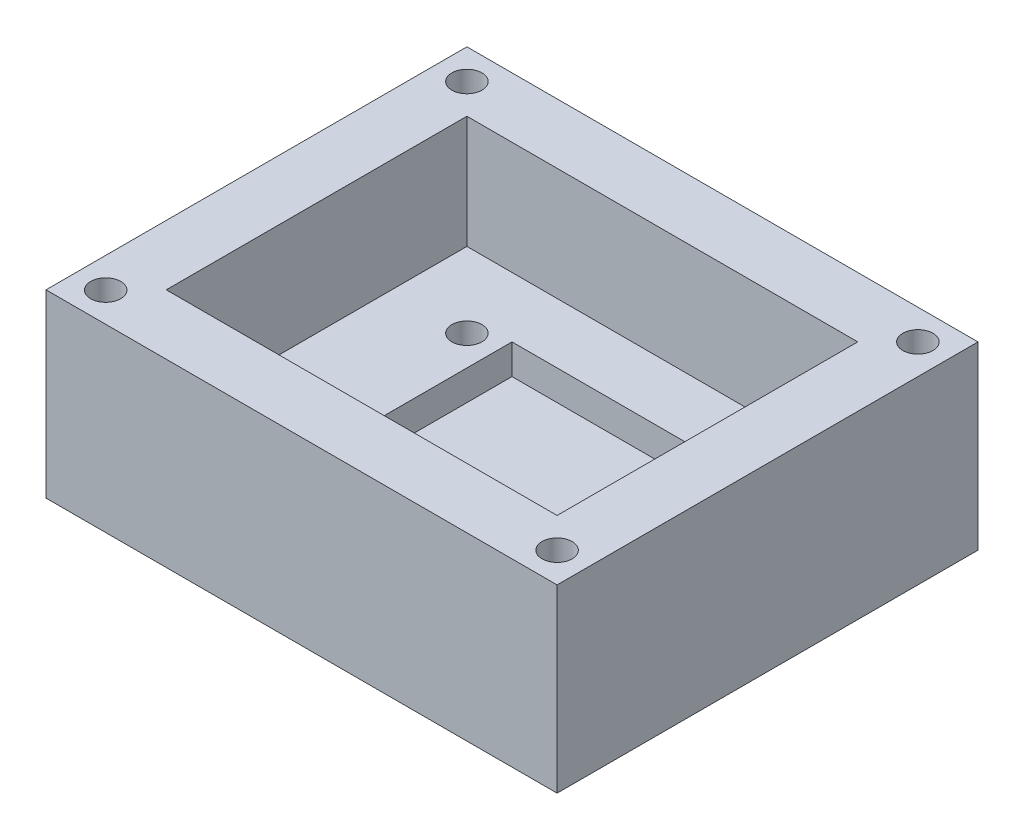
ISO-10303-21;
HEADER;
FILE_DESCRIPTION(('STEP AP214'),'2;1');
FILE_NAME('part.step','',(''),(''),'','','');
FILE_SCHEMA(('AUTOMOTIVE_DESIGN { 1 0 10303 214 1 1 1 1 }'));
ENDSEC;
DATA;
#1=APPLICATION_CONTEXT('core data for automotive mechanical design processes');
#2=APPLICATION_PROTOCOL_DEFINITION('international standard','automotive_design',2000,#1);
#3=PRODUCT_CONTEXT('',#1,'mechanical');
#4=PRODUCT('Part','Part','',(#3));
#5=PRODUCT_RELATED_PRODUCT_CATEGORY('part','',(#4));
#6=PRODUCT_DEFINITION_FORMATION('','',#4);
#7=PRODUCT_DEFINITION_CONTEXT('part definition',#1,'design');
#8=PRODUCT_DEFINITION('design','',#6,#7);
#9=PRODUCT_DEFINITION_SHAPE('','',#8);
#10=(LENGTH_UNIT() NAMED_UNIT(*) SI_UNIT(.MILLI.,.METRE.));
#11=(NAMED_UNIT(*) PLANE_ANGLE_UNIT() SI_UNIT($,.RADIAN.));
#12=(NAMED_UNIT(*) SI_UNIT($,.STERADIAN.) SOLID_ANGLE_UNIT());
#13=UNCERTAINTY_MEASURE_WITH_UNIT(LENGTH_MEASURE(1.E-05),#10,'distance_accuracy_value','');
#14=(GEOMETRIC_REPRESENTATION_CONTEXT(3) GLOBAL_UNCERTAINTY_ASSIGNED_CONTEXT((#13)) GLOBAL_UNIT_ASSIGNED_CONTEXT((#10,
#11,#12)) REPRESENTATION_CONTEXT('',''));
#15=CARTESIAN_POINT('',(0.,0.,0.));
#16=DIRECTION('',(0.,0.,1.));
#17=DIRECTION('',(1.,0.,0.));
#18=AXIS2_PLACEMENT_3D('',#15,#16,#17);
#19=CARTESIAN_POINT('',(-16.6948356807512,15.24,-8.70516431924882));
#20=DIRECTION('',(1.,0.,0.));
#21=DIRECTION('',(0.,0.,-1.));
#22=AXIS2_PLACEMENT_3D('',#19,#20,#21);
#23=PLANE('',#22);
#24=DIRECTION('',(0.,0.,1.));
#25=VECTOR('',#24,1.);
#26=CARTESIAN_POINT('',(-16.6948356807512,0.,-8.70516431924882));
#27=LINE('',#26,#25);
#28=CARTESIAN_POINT('',(-16.6948356807512,0.,-8.70516431924882));
#29=VERTEX_POINT('',#28);
#30=CARTESIAN_POINT('',(-16.6948356807512,0.,26.8548356807512));
#31=VERTEX_POINT('',#30);
#32=EDGE_CURVE('E189',#29,#31,#27,.T.);
#33=ORIENTED_EDGE('',*,*,#32,.T.);
#34=DIRECTION('',(0.,-1.,0.));
#35=VECTOR('',#34,1.);
#36=CARTESIAN_POINT('',(-16.6948356807512,15.24,26.8548356807512));
#37=LINE('',#36,#35);
#38=CARTESIAN_POINT('',(-16.6948356807512,15.24,26.8548356807512));
#39=VERTEX_POINT('',#38);
#40=EDGE_CURVE('E11',#39,#31,#37,.T.);
#41=ORIENTED_EDGE('',*,*,#40,.F.);
#42=DIRECTION('',(0.,0.,1.));
#43=VECTOR('',#42,1.);
#44=CARTESIAN_POINT('',(-16.6948356807512,15.24,-8.70516431924882));
#45=LINE('',#44,#43);
#46=CARTESIAN_POINT('',(-16.6948356807512,15.24,-8.70516431924882));
#47=VERTEX_POINT('',#46);
#48=EDGE_CURVE('E195',#47,#39,#45,.T.);
#49=ORIENTED_EDGE('',*,*,#48,.F.);
#50=DIRECTION('',(0.,-1.,0.));
#51=VECTOR('',#50,1.);
#52=CARTESIAN_POINT('',(-16.6948356807512,15.24,-8.70516431924882));
#53=LINE('',#52,#51);
#54=EDGE_CURVE('E205',#47,#29,#53,.T.);
#55=ORIENTED_EDGE('',*,*,#54,.T.);
#56=EDGE_LOOP('',(#33,#41,#49,#55));
#57=FACE_BOUND('',#56,.T.);
#58=ADVANCED_FACE('F32',(#57),#23,.F.);
#59=CARTESIAN_POINT('',(-16.6948356807512,15.24,26.8548356807512));
#60=DIRECTION('',(0.,0.,-1.));
#61=DIRECTION('',(-1.,0.,0.));
#62=AXIS2_PLACEMENT_3D('',#59,#60,#61);
#63=PLANE('',#62);
#64=DIRECTION('',(1.,0.,0.));
#65=VECTOR('',#64,1.);
#66=CARTESIAN_POINT('',(-16.6948356807512,0.,26.8548356807512));
#67=LINE('',#66,#65);
#68=CARTESIAN_POINT('',(26.4851643192488,0.,26.8548356807512));
#69=VERTEX_POINT('',#68);
#70=EDGE_CURVE('E208',#31,#69,#67,.T.);
#71=ORIENTED_EDGE('',*,*,#70,.T.);
#72=DIRECTION('',(0.,-1.,0.));
#73=VECTOR('',#72,1.);
#74=CARTESIAN_POINT('',(26.4851643192488,15.24,26.8548356807512));
#75=LINE('',#74,#73);
#76=CARTESIAN_POINT('',(26.4851643192488,15.24,26.8548356807512));
#77=VERTEX_POINT('',#76);
#78=EDGE_CURVE('E39',#77,#69,#75,.T.);
#79=ORIENTED_EDGE('',*,*,#78,.F.);
#80=DIRECTION('',(1.,0.,0.));
#81=VECTOR('',#80,1.);
#82=CARTESIAN_POINT('',(-16.6948356807512,15.24,26.8548356807512));
#83=LINE('',#82,#81);
#84=EDGE_CURVE('E198',#39,#77,#83,.T.);
#85=ORIENTED_EDGE('',*,*,#84,.F.);
#86=ORIENTED_EDGE('',*,*,#40,.T.);
#87=EDGE_LOOP('',(#71,#79,#85,#86));
#88=FACE_BOUND('',#87,.T.);
#89=ADVANCED_FACE('F238',(#88),#63,.F.);
#90=CARTESIAN_POINT('',(26.4851643192488,15.24,-8.70516431924882));
#91=DIRECTION('',(-1.,0.,0.));
#92=DIRECTION('',(0.,0.,1.));
#93=AXIS2_PLACEMENT_3D('',#90,#91,#92);
#94=PLANE('',#93);
#95=DIRECTION('',(0.,0.,-1.));
#96=VECTOR('',#95,1.);
#97=CARTESIAN_POINT('',(26.4851643192488,0.,-8.70516431924882));
#98=LINE('',#97,#96);
#99=CARTESIAN_POINT('',(26.4851643192488,0.,-8.70516431924882));
#100=VERTEX_POINT('',#99);
#101=EDGE_CURVE('E210',#69,#100,#98,.T.);
#102=ORIENTED_EDGE('',*,*,#101,.T.);
#103=DIRECTION('',(0.,-1.,0.));
#104=VECTOR('',#103,1.);
#105=CARTESIAN_POINT('',(26.4851643192488,15.24,-8.70516431924882));
#106=LINE('',#105,#104);
#107=CARTESIAN_POINT('',(26.4851643192488,15.24,-8.70516431924882));
#108=VERTEX_POINT('',#107);
#109=EDGE_CURVE('E215',#108,#100,#106,.T.);
#110=ORIENTED_EDGE('',*,*,#109,.F.);
#111=DIRECTION('',(0.,0.,-1.));
#112=VECTOR('',#111,1.);
#113=CARTESIAN_POINT('',(26.4851643192488,15.24,-8.70516431924882));
#114=LINE('',#113,#112);
#115=EDGE_CURVE('E201',#77,#108,#114,.T.);
#116=ORIENTED_EDGE('',*,*,#115,.F.);
#117=ORIENTED_EDGE('',*,*,#78,.T.);
#118=EDGE_LOOP('',(#102,#110,#116,#117));
#119=FACE_BOUND('',#118,.T.);
#120=ADVANCED_FACE('F222',(#119),#94,.F.);
#121=CARTESIAN_POINT('',(-16.6948356807512,15.24,-8.70516431924882));
#122=DIRECTION('',(0.,0.,1.));
#123=DIRECTION('',(1.,0.,0.));
#124=AXIS2_PLACEMENT_3D('',#121,#122,#123);
#125=PLANE('',#124);
#126=DIRECTION('',(-1.,0.,0.));
#127=VECTOR('',#126,1.);
#128=CARTESIAN_POINT('',(-16.6948356807512,0.,-8.70516431924882));
#129=LINE('',#128,#127);
#130=EDGE_CURVE('E199',#100,#29,#129,.T.);
#131=ORIENTED_EDGE('',*,*,#130,.T.);
#132=ORIENTED_EDGE('',*,*,#54,.F.);
#133=DIRECTION('',(-1.,0.,0.));
#134=VECTOR('',#133,1.);
#135=CARTESIAN_POINT('',(-16.6948356807512,15.24,-8.70516431924882));
#136=LINE('',#135,#134);
#137=EDGE_CURVE('E203',#108,#47,#136,.T.);
#138=ORIENTED_EDGE('',*,*,#137,.F.);
#139=ORIENTED_EDGE('',*,*,#109,.T.);
#140=EDGE_LOOP('',(#131,#132,#138,#139));
#141=FACE_BOUND('',#140,.T.);
#142=ADVANCED_FACE('F231',(#141),#125,.F.);
#143=CARTESIAN_POINT('',(0.,15.24,0.));
#144=DIRECTION('',(0.,1.,0.));
#145=DIRECTION('',(0.,0.,1.));
#146=AXIS2_PLACEMENT_3D('',#143,#144,#145);
#147=PLANE('',#146);
#148=CARTESIAN_POINT('',(-14.1548356807512,15.24,24.3531912337531));
#149=DIRECTION('',(0.,1.,0.));
#150=DIRECTION('',(0.,0.,1.));
#151=AXIS2_PLACEMENT_3D('',#148,#149,#150);
#152=CIRCLE('',#151,1.27);
#153=CARTESIAN_POINT('',(-14.1548356807512,15.24,25.6231912337531));
#154=VERTEX_POINT('',#153);
#155=EDGE_CURVE('E335',#154,#154,#152,.T.);
#156=ORIENTED_EDGE('',*,*,#155,.F.);
#157=EDGE_LOOP('',(#156));
#158=FACE_BOUND('',#157,.T.);
#159=CARTESIAN_POINT('',(23.9451643192488,15.24,-6.16516431924882));
#160=DIRECTION('',(0.,1.,0.));
#161=DIRECTION('',(0.,0.,1.));
#162=AXIS2_PLACEMENT_3D('',#159,#160,#161);
#163=CIRCLE('',#162,1.27);
#164=CARTESIAN_POINT('',(23.9451643192488,15.24,-4.89516431924882));
#165=VERTEX_POINT('',#164);
#166=EDGE_CURVE('E328',#165,#165,#163,.T.);
#167=ORIENTED_EDGE('',*,*,#166,.F.);
#168=EDGE_LOOP('',(#167));
#169=FACE_BOUND('',#168,.T.);
#170=CARTESIAN_POINT('',(23.9451643192488,15.24,24.3148356807512));
#171=DIRECTION('',(0.,1.,0.));
#172=DIRECTION('',(0.,0.,1.));
#173=AXIS2_PLACEMENT_3D('',#170,#171,#172);
#174=CIRCLE('',#173,1.27);
#175=CARTESIAN_POINT('',(23.9451643192488,15.24,25.5848356807512));
#176=VERTEX_POINT('',#175);
#177=EDGE_CURVE('E325',#176,#176,#174,.T.);
#178=ORIENTED_EDGE('',*,*,#177,.F.);
#179=EDGE_LOOP('',(#178));
#180=FACE_BOUND('',#179,.T.);
#181=CARTESIAN_POINT('',(-14.1548356807512,15.24,-6.16516431924882));
#182=DIRECTION('',(0.,1.,0.));
#183=DIRECTION('',(0.,0.,1.));
#184=AXIS2_PLACEMENT_3D('',#181,#182,#183);
#185=CIRCLE('',#184,1.27);
#186=CARTESIAN_POINT('',(-14.1548356807512,15.24,-4.89516431924882));
#187=VERTEX_POINT('',#186);
#188=EDGE_CURVE('E334',#187,#187,#185,.T.);
#189=ORIENTED_EDGE('',*,*,#188,.F.);
#190=EDGE_LOOP('',(#189));
#191=FACE_BOUND('',#190,.T.);
#192=DIRECTION('',(0.,0.,1.));
#193=VECTOR('',#192,1.);
#194=CARTESIAN_POINT('',(-11.6148356807512,15.24,-3.62516431924883));
#195=LINE('',#194,#193);
#196=CARTESIAN_POINT('',(-11.6148356807512,15.24,-3.62516431924883));
#197=VERTEX_POINT('',#196);
#198=CARTESIAN_POINT('',(-11.6148356807512,15.24,21.7748356807512));
#199=VERTEX_POINT('',#198);
#200=EDGE_CURVE('E54',#197,#199,#195,.T.);
#201=ORIENTED_EDGE('',*,*,#200,.F.);
#202=DIRECTION('',(-1.,0.,0.));
#203=VECTOR('',#202,1.);
#204=CARTESIAN_POINT('',(-11.6148356807512,15.24,-3.62516431924883));
#205=LINE('',#204,#203);
#206=CARTESIAN_POINT('',(21.4051643192488,15.24,-3.62516431924883));
#207=VERTEX_POINT('',#206);
#208=EDGE_CURVE('E168',#207,#197,#205,.T.);
#209=ORIENTED_EDGE('',*,*,#208,.F.);
#210=DIRECTION('',(0.,0.,-1.));
#211=VECTOR('',#210,1.);
#212=CARTESIAN_POINT('',(21.4051643192488,15.24,-3.62516431924883));
#213=LINE('',#212,#211);
#214=CARTESIAN_POINT('',(21.4051643192488,15.24,21.7748356807512));
#215=VERTEX_POINT('',#214);
#216=EDGE_CURVE('E182',#215,#207,#213,.T.);
#217=ORIENTED_EDGE('',*,*,#216,.F.);
#218=DIRECTION('',(1.,0.,0.));
#219=VECTOR('',#218,1.);
#220=CARTESIAN_POINT('',(-11.6148356807512,15.24,21.7748356807512));
#221=LINE('',#220,#219);
#222=EDGE_CURVE('E179',#199,#215,#221,.T.);
#223=ORIENTED_EDGE('',*,*,#222,.F.);
#224=EDGE_LOOP('',(#201,#209,#217,#223));
#225=FACE_BOUND('',#224,.T.);
#226=ORIENTED_EDGE('',*,*,#48,.T.);
#227=ORIENTED_EDGE('',*,*,#84,.T.);
#228=ORIENTED_EDGE('',*,*,#115,.T.);
#229=ORIENTED_EDGE('',*,*,#137,.T.);
#230=EDGE_LOOP('',(#226,#227,#228,#229));
#231=FACE_BOUND('',#230,.T.);
#232=ADVANCED_FACE('F237',(#158,#169,#180,#191,#225,#231),#147,.T.);
#233=CARTESIAN_POINT('',(0.,0.,0.));
#234=DIRECTION('',(0.,1.,0.));
#235=DIRECTION('',(0.,0.,1.));
#236=AXIS2_PLACEMENT_3D('',#233,#234,#235);
#237=PLANE('',#236);
#238=CARTESIAN_POINT('',(-14.1548356807512,0.,24.3531912337531));
#239=DIRECTION('',(0.,1.,0.));
#240=DIRECTION('',(0.,0.,1.));
#241=AXIS2_PLACEMENT_3D('',#238,#239,#240);
#242=CIRCLE('',#241,1.27);
#243=CARTESIAN_POINT('',(-14.1548356807512,0.,25.6231912337531));
#244=VERTEX_POINT('',#243);
#245=EDGE_CURVE('E331',#244,#244,#242,.T.);
#246=ORIENTED_EDGE('',*,*,#245,.T.);
#247=EDGE_LOOP('',(#246));
#248=FACE_BOUND('',#247,.T.);
#249=CARTESIAN_POINT('',(23.9451643192488,0.,-6.16516431924882));
#250=DIRECTION('',(0.,1.,0.));
#251=DIRECTION('',(0.,0.,1.));
#252=AXIS2_PLACEMENT_3D('',#249,#250,#251);
#253=CIRCLE('',#252,1.27);
#254=CARTESIAN_POINT('',(23.9451643192488,0.,-4.89516431924882));
#255=VERTEX_POINT('',#254);
#256=EDGE_CURVE('E338',#255,#255,#253,.T.);
#257=ORIENTED_EDGE('',*,*,#256,.T.);
#258=EDGE_LOOP('',(#257));
#259=FACE_BOUND('',#258,.T.);
#260=CARTESIAN_POINT('',(23.9451643192488,0.,24.3148356807512));
#261=DIRECTION('',(0.,1.,0.));
#262=DIRECTION('',(0.,0.,1.));
#263=AXIS2_PLACEMENT_3D('',#260,#261,#262);
#264=CIRCLE('',#263,1.27);
#265=CARTESIAN_POINT('',(23.9451643192488,0.,25.5848356807512));
#266=VERTEX_POINT('',#265);
#267=EDGE_CURVE('E322',#266,#266,#264,.T.);
#268=ORIENTED_EDGE('',*,*,#267,.T.);
#269=EDGE_LOOP('',(#268));
#270=FACE_BOUND('',#269,.T.);
#271=CARTESIAN_POINT('',(-14.1548356807512,0.,-6.16516431924882));
#272=DIRECTION('',(0.,1.,0.));
#273=DIRECTION('',(0.,0.,1.));
#274=AXIS2_PLACEMENT_3D('',#271,#272,#273);
#275=CIRCLE('',#274,1.27);
#276=CARTESIAN_POINT('',(-14.1548356807512,0.,-4.89516431924882));
#277=VERTEX_POINT('',#276);
#278=EDGE_CURVE('E343',#277,#277,#275,.T.);
#279=ORIENTED_EDGE('',*,*,#278,.T.);
#280=EDGE_LOOP('',(#279));
#281=FACE_BOUND('',#280,.T.);
#282=CARTESIAN_POINT('',(-5.26483568075119,0.,15.4248356807512));
#283=DIRECTION('',(0.,1.,0.));
#284=DIRECTION('',(0.,0.,1.));
#285=AXIS2_PLACEMENT_3D('',#282,#283,#284);
#286=CIRCLE('',#285,1.27);
#287=CARTESIAN_POINT('',(-5.26483568075119,0.,16.6948356807512));
#288=VERTEX_POINT('',#287);
#289=EDGE_CURVE('E355',#288,#288,#286,.T.);
#290=ORIENTED_EDGE('',*,*,#289,.T.);
#291=EDGE_LOOP('',(#290));
#292=FACE_BOUND('',#291,.T.);
#293=CARTESIAN_POINT('',(15.0551643192488,0.,2.72483568075117));
#294=DIRECTION('',(0.,1.,0.));
#295=DIRECTION('',(0.,0.,1.));
#296=AXIS2_PLACEMENT_3D('',#293,#294,#295);
#297=CIRCLE('',#296,1.27);
#298=CARTESIAN_POINT('',(15.0551643192488,0.,3.99483568075117));
#299=VERTEX_POINT('',#298);
#300=EDGE_CURVE('E361',#299,#299,#297,.T.);
#301=ORIENTED_EDGE('',*,*,#300,.T.);
#302=EDGE_LOOP('',(#301));
#303=FACE_BOUND('',#302,.T.);
#304=CARTESIAN_POINT('',(15.0551643192488,0.,15.4248356807512));
#305=DIRECTION('',(0.,1.,0.));
#306=DIRECTION('',(0.,0.,1.));
#307=AXIS2_PLACEMENT_3D('',#304,#305,#306);
#308=CIRCLE('',#307,1.27);
#309=CARTESIAN_POINT('',(15.0551643192488,0.,16.6948356807512));
#310=VERTEX_POINT('',#309);
#311=EDGE_CURVE('E349',#310,#310,#308,.T.);
#312=ORIENTED_EDGE('',*,*,#311,.T.);
#313=EDGE_LOOP('',(#312));
#314=FACE_BOUND('',#313,.T.);
#315=CARTESIAN_POINT('',(-5.26483568075119,0.,2.72483568075117));
#316=DIRECTION('',(0.,1.,0.));
#317=DIRECTION('',(0.,0.,1.));
#318=AXIS2_PLACEMENT_3D('',#315,#316,#317);
#319=CIRCLE('',#318,1.27);
#320=CARTESIAN_POINT('',(-5.26483568075119,0.,3.99483568075117));
#321=VERTEX_POINT('',#320);
#322=EDGE_CURVE('E156',#321,#321,#319,.T.);
#323=ORIENTED_EDGE('',*,*,#322,.T.);
#324=EDGE_LOOP('',(#323));
#325=FACE_BOUND('',#324,.T.);
#326=ORIENTED_EDGE('',*,*,#32,.F.);
#327=ORIENTED_EDGE('',*,*,#130,.F.);
#328=ORIENTED_EDGE('',*,*,#101,.F.);
#329=ORIENTED_EDGE('',*,*,#70,.F.);
#330=EDGE_LOOP('',(#326,#327,#328,#329));
#331=FACE_BOUND('',#330,.T.);
#332=ADVANCED_FACE('F228',(#248,#259,#270,#281,#292,#303,#314,#325,#331),#237,.F.);
#333=CARTESIAN_POINT('',(-11.6148356807512,5.715,-3.62516431924883));
#334=DIRECTION('',(-1.,0.,0.));
#335=DIRECTION('',(0.,0.,1.));
#336=AXIS2_PLACEMENT_3D('',#333,#334,#335);
#337=PLANE('',#336);
#338=ORIENTED_EDGE('',*,*,#200,.T.);
#339=DIRECTION('',(0.,1.,0.));
#340=VECTOR('',#339,1.);
#341=CARTESIAN_POINT('',(-11.6148356807512,5.715,21.7748356807512));
#342=LINE('',#341,#340);
#343=CARTESIAN_POINT('',(-11.6148356807512,5.715,21.7748356807512));
#344=VERTEX_POINT('',#343);
#345=EDGE_CURVE('E177',#344,#199,#342,.T.);
#346=ORIENTED_EDGE('',*,*,#345,.F.);
#347=DIRECTION('',(0.,0.,1.));
#348=VECTOR('',#347,1.);
#349=CARTESIAN_POINT('',(-11.6148356807512,5.715,-3.62516431924883));
#350=LINE('',#349,#348);
#351=CARTESIAN_POINT('',(-11.6148356807512,5.715,-3.62516431924883));
#352=VERTEX_POINT('',#351);
#353=EDGE_CURVE('E164',#352,#344,#350,.T.);
#354=ORIENTED_EDGE('',*,*,#353,.F.);
#355=DIRECTION('',(0.,1.,0.));
#356=VECTOR('',#355,1.);
#357=CARTESIAN_POINT('',(-11.6148356807512,5.715,-3.62516431924883));
#358=LINE('',#357,#356);
#359=EDGE_CURVE('E187',#352,#197,#358,.T.);
#360=ORIENTED_EDGE('',*,*,#359,.T.);
#361=EDGE_LOOP('',(#338,#346,#354,#360));
#362=FACE_BOUND('',#361,.T.);
#363=ADVANCED_FACE('F250',(#362),#337,.F.);
#364=CARTESIAN_POINT('',(-11.6148356807512,5.715,-3.62516431924883));
#365=DIRECTION('',(0.,0.,-1.));
#366=DIRECTION('',(-1.,0.,0.));
#367=AXIS2_PLACEMENT_3D('',#364,#365,#366);
#368=PLANE('',#367);
#369=ORIENTED_EDGE('',*,*,#208,.T.);
#370=ORIENTED_EDGE('',*,*,#359,.F.);
#371=DIRECTION('',(-1.,0.,0.));
#372=VECTOR('',#371,1.);
#373=CARTESIAN_POINT('',(-11.6148356807512,5.715,-3.62516431924883));
#374=LINE('',#373,#372);
#375=CARTESIAN_POINT('',(21.4051643192488,5.715,-3.62516431924883));
#376=VERTEX_POINT('',#375);
#377=EDGE_CURVE('E174',#376,#352,#374,.T.);
#378=ORIENTED_EDGE('',*,*,#377,.F.);
#379=DIRECTION('',(0.,1.,0.));
#380=VECTOR('',#379,1.);
#381=CARTESIAN_POINT('',(21.4051643192488,5.715,-3.62516431924883));
#382=LINE('',#381,#380);
#383=EDGE_CURVE('E190',#376,#207,#382,.T.);
#384=ORIENTED_EDGE('',*,*,#383,.T.);
#385=EDGE_LOOP('',(#369,#370,#378,#384));
#386=FACE_BOUND('',#385,.T.);
#387=ADVANCED_FACE('F257',(#386),#368,.F.);
#388=CARTESIAN_POINT('',(21.4051643192488,5.715,-3.62516431924883));
#389=DIRECTION('',(1.,0.,0.));
#390=DIRECTION('',(0.,0.,-1.));
#391=AXIS2_PLACEMENT_3D('',#388,#389,#390);
#392=PLANE('',#391);
#393=ORIENTED_EDGE('',*,*,#216,.T.);
#394=ORIENTED_EDGE('',*,*,#383,.F.);
#395=DIRECTION('',(0.,0.,-1.));
#396=VECTOR('',#395,1.);
#397=CARTESIAN_POINT('',(21.4051643192488,5.715,-3.62516431924883));
#398=LINE('',#397,#396);
#399=CARTESIAN_POINT('',(21.4051643192488,5.715,21.7748356807512));
#400=VERTEX_POINT('',#399);
#401=EDGE_CURVE('E171',#400,#376,#398,.T.);
#402=ORIENTED_EDGE('',*,*,#401,.F.);
#403=DIRECTION('',(0.,1.,0.));
#404=VECTOR('',#403,1.);
#405=CARTESIAN_POINT('',(21.4051643192488,5.715,21.7748356807512));
#406=LINE('',#405,#404);
#407=EDGE_CURVE('E192',#400,#215,#406,.T.);
#408=ORIENTED_EDGE('',*,*,#407,.T.);
#409=EDGE_LOOP('',(#393,#394,#402,#408));
#410=FACE_BOUND('',#409,.T.);
#411=ADVANCED_FACE('F262',(#410),#392,.F.);
#412=CARTESIAN_POINT('',(-11.6148356807512,5.715,21.7748356807512));
#413=DIRECTION('',(0.,0.,1.));
#414=DIRECTION('',(1.,0.,0.));
#415=AXIS2_PLACEMENT_3D('',#412,#413,#414);
#416=PLANE('',#415);
#417=ORIENTED_EDGE('',*,*,#222,.T.);
#418=ORIENTED_EDGE('',*,*,#407,.F.);
#419=DIRECTION('',(1.,0.,0.));
#420=VECTOR('',#419,1.);
#421=CARTESIAN_POINT('',(-11.6148356807512,5.715,21.7748356807512));
#422=LINE('',#421,#420);
#423=EDGE_CURVE('E167',#344,#400,#422,.T.);
#424=ORIENTED_EDGE('',*,*,#423,.F.);
#425=ORIENTED_EDGE('',*,*,#345,.T.);
#426=EDGE_LOOP('',(#417,#418,#424,#425));
#427=FACE_BOUND('',#426,.T.);
#428=ADVANCED_FACE('F258',(#427),#416,.F.);
#429=CARTESIAN_POINT('',(0.,5.715,0.));
#430=DIRECTION('',(0.,1.,0.));
#431=DIRECTION('',(0.,0.,1.));
#432=AXIS2_PLACEMENT_3D('',#429,#430,#431);
#433=PLANE('',#432);
#434=CARTESIAN_POINT('',(-5.26483568075119,5.715,15.4248356807512));
#435=DIRECTION('',(0.,1.,0.));
#436=DIRECTION('',(0.,0.,1.));
#437=AXIS2_PLACEMENT_3D('',#434,#435,#436);
#438=CIRCLE('',#437,1.27);
#439=CARTESIAN_POINT('',(-5.26483568075119,5.715,16.6948356807512));
#440=VERTEX_POINT('',#439);
#441=EDGE_CURVE('E358',#440,#440,#438,.T.);
#442=ORIENTED_EDGE('',*,*,#441,.F.);
#443=EDGE_LOOP('',(#442));
#444=FACE_BOUND('',#443,.T.);
#445=CARTESIAN_POINT('',(15.0551643192488,5.715,2.72483568075117));
#446=DIRECTION('',(0.,1.,0.));
#447=DIRECTION('',(0.,0.,1.));
#448=AXIS2_PLACEMENT_3D('',#445,#446,#447);
#449=CIRCLE('',#448,1.27);
#450=CARTESIAN_POINT('',(15.0551643192488,5.715,3.99483568075117));
#451=VERTEX_POINT('',#450);
#452=EDGE_CURVE('E352',#451,#451,#449,.T.);
#453=ORIENTED_EDGE('',*,*,#452,.F.);
#454=EDGE_LOOP('',(#453));
#455=FACE_BOUND('',#454,.T.);
#456=CARTESIAN_POINT('',(15.0551643192488,5.715,15.4248356807512));
#457=DIRECTION('',(0.,1.,0.));
#458=DIRECTION('',(0.,0.,1.));
#459=AXIS2_PLACEMENT_3D('',#456,#457,#458);
#460=CIRCLE('',#459,1.27);
#461=CARTESIAN_POINT('',(15.0551643192488,5.715,16.6948356807512));
#462=VERTEX_POINT('',#461);
#463=EDGE_CURVE('E346',#462,#462,#460,.T.);
#464=ORIENTED_EDGE('',*,*,#463,.F.);
#465=EDGE_LOOP('',(#464));
#466=FACE_BOUND('',#465,.T.);
#467=CARTESIAN_POINT('',(-5.26483568075119,5.715,2.72483568075117));
#468=DIRECTION('',(0.,1.,0.));
#469=DIRECTION('',(0.,0.,1.));
#470=AXIS2_PLACEMENT_3D('',#467,#468,#469);
#471=CIRCLE('',#470,1.27);
#472=CARTESIAN_POINT('',(-5.26483568075119,5.715,3.99483568075117));
#473=VERTEX_POINT('',#472);
#474=EDGE_CURVE('E149',#473,#473,#471,.T.);
#475=ORIENTED_EDGE('',*,*,#474,.F.);
#476=EDGE_LOOP('',(#475));
#477=FACE_BOUND('',#476,.T.);
#478=DIRECTION('',(0.,0.,1.));
#479=VECTOR('',#478,1.);
#480=CARTESIAN_POINT('',(-2.72483568075119,5.715,1.45483568075117));
#481=LINE('',#480,#479);
#482=CARTESIAN_POINT('',(-2.72483568075119,5.715,1.45483568075117));
#483=VERTEX_POINT('',#482);
#484=CARTESIAN_POINT('',(-2.72483568075119,5.715,16.6948356807512));
#485=VERTEX_POINT('',#484);
#486=EDGE_CURVE('E127',#483,#485,#481,.T.);
#487=ORIENTED_EDGE('',*,*,#486,.F.);
#488=DIRECTION('',(-1.,0.,0.));
#489=VECTOR('',#488,1.);
#490=CARTESIAN_POINT('',(-2.72483568075119,5.715,1.45483568075117));
#491=LINE('',#490,#489);
#492=CARTESIAN_POINT('',(12.5151643192488,5.715,1.45483568075117));
#493=VERTEX_POINT('',#492);
#494=EDGE_CURVE('E144',#493,#483,#491,.T.);
#495=ORIENTED_EDGE('',*,*,#494,.F.);
#496=DIRECTION('',(0.,0.,-1.));
#497=VECTOR('',#496,1.);
#498=CARTESIAN_POINT('',(12.5151643192488,5.715,1.45483568075117));
#499=LINE('',#498,#497);
#500=CARTESIAN_POINT('',(12.5151643192488,5.715,16.6948356807512));
#501=VERTEX_POINT('',#500);
#502=EDGE_CURVE('E46',#501,#493,#499,.T.);
#503=ORIENTED_EDGE('',*,*,#502,.F.);
#504=DIRECTION('',(1.,0.,0.));
#505=VECTOR('',#504,1.);
#506=CARTESIAN_POINT('',(-2.72483568075119,5.715,16.6948356807512));
#507=LINE('',#506,#505);
#508=EDGE_CURVE('E155',#485,#501,#507,.T.);
#509=ORIENTED_EDGE('',*,*,#508,.F.);
#510=EDGE_LOOP('',(#487,#495,#503,#509));
#511=FACE_BOUND('',#510,.T.);
#512=ORIENTED_EDGE('',*,*,#353,.T.);
#513=ORIENTED_EDGE('',*,*,#423,.T.);
#514=ORIENTED_EDGE('',*,*,#401,.T.);
#515=ORIENTED_EDGE('',*,*,#377,.T.);
#516=EDGE_LOOP('',(#512,#513,#514,#515));
#517=FACE_BOUND('',#516,.T.);
#518=ADVANCED_FACE('F261',(#444,#455,#466,#477,#511,#517),#433,.T.);
#519=CARTESIAN_POINT('',(-2.72483568075119,3.175,1.45483568075117));
#520=DIRECTION('',(-1.,0.,0.));
#521=DIRECTION('',(0.,0.,1.));
#522=AXIS2_PLACEMENT_3D('',#519,#520,#521);
#523=PLANE('',#522);
#524=ORIENTED_EDGE('',*,*,#486,.T.);
#525=DIRECTION('',(0.,1.,0.));
#526=VECTOR('',#525,1.);
#527=CARTESIAN_POINT('',(-2.72483568075119,3.175,16.6948356807512));
#528=LINE('',#527,#526);
#529=CARTESIAN_POINT('',(-2.72483568075119,3.175,16.6948356807512));
#530=VERTEX_POINT('',#529);
#531=EDGE_CURVE('E120',#530,#485,#528,.T.);
#532=ORIENTED_EDGE('',*,*,#531,.F.);
#533=DIRECTION('',(0.,0.,1.));
#534=VECTOR('',#533,1.);
#535=CARTESIAN_POINT('',(-2.72483568075119,3.175,1.45483568075117));
#536=LINE('',#535,#534);
#537=CARTESIAN_POINT('',(-2.72483568075119,3.175,1.45483568075117));
#538=VERTEX_POINT('',#537);
#539=EDGE_CURVE('E124',#538,#530,#536,.T.);
#540=ORIENTED_EDGE('',*,*,#539,.F.);
#541=DIRECTION('',(0.,1.,0.));
#542=VECTOR('',#541,1.);
#543=CARTESIAN_POINT('',(-2.72483568075119,3.175,1.45483568075117));
#544=LINE('',#543,#542);
#545=EDGE_CURVE('E159',#538,#483,#544,.T.);
#546=ORIENTED_EDGE('',*,*,#545,.T.);
#547=EDGE_LOOP('',(#524,#532,#540,#546));
#548=FACE_BOUND('',#547,.T.);
#549=ADVANCED_FACE('F122',(#548),#523,.F.);
#550=CARTESIAN_POINT('',(-2.72483568075119,3.175,1.45483568075117));
#551=DIRECTION('',(0.,0.,-1.));
#552=DIRECTION('',(-1.,0.,0.));
#553=AXIS2_PLACEMENT_3D('',#550,#551,#552);
#554=PLANE('',#553);
#555=ORIENTED_EDGE('',*,*,#494,.T.);
#556=ORIENTED_EDGE('',*,*,#545,.F.);
#557=DIRECTION('',(-1.,0.,0.));
#558=VECTOR('',#557,1.);
#559=CARTESIAN_POINT('',(-2.72483568075119,3.175,1.45483568075117));
#560=LINE('',#559,#558);
#561=CARTESIAN_POINT('',(12.5151643192488,3.175,1.45483568075117));
#562=VERTEX_POINT('',#561);
#563=EDGE_CURVE('E132',#562,#538,#560,.T.);
#564=ORIENTED_EDGE('',*,*,#563,.F.);
#565=DIRECTION('',(0.,1.,0.));
#566=VECTOR('',#565,1.);
#567=CARTESIAN_POINT('',(12.5151643192488,3.175,1.45483568075117));
#568=LINE('',#567,#566);
#569=EDGE_CURVE('E161',#562,#493,#568,.T.);
#570=ORIENTED_EDGE('',*,*,#569,.T.);
#571=EDGE_LOOP('',(#555,#556,#564,#570));
#572=FACE_BOUND('',#571,.T.);
#573=ADVANCED_FACE('F275',(#572),#554,.F.);
#574=CARTESIAN_POINT('',(12.5151643192488,3.175,1.45483568075117));
#575=DIRECTION('',(1.,0.,0.));
#576=DIRECTION('',(0.,0.,-1.));
#577=AXIS2_PLACEMENT_3D('',#574,#575,#576);
#578=PLANE('',#577);
#579=ORIENTED_EDGE('',*,*,#502,.T.);
#580=ORIENTED_EDGE('',*,*,#569,.F.);
#581=DIRECTION('',(0.,0.,-1.));
#582=VECTOR('',#581,1.);
#583=CARTESIAN_POINT('',(12.5151643192488,3.175,1.45483568075117));
#584=LINE('',#583,#582);
#585=CARTESIAN_POINT('',(12.5151643192488,3.175,16.6948356807512));
#586=VERTEX_POINT('',#585);
#587=EDGE_CURVE('E140',#586,#562,#584,.T.);
#588=ORIENTED_EDGE('',*,*,#587,.F.);
#589=DIRECTION('',(0.,1.,0.));
#590=VECTOR('',#589,1.);
#591=CARTESIAN_POINT('',(12.5151643192488,3.175,16.6948356807512));
#592=LINE('',#591,#590);
#593=EDGE_CURVE('E131',#586,#501,#592,.T.);
#594=ORIENTED_EDGE('',*,*,#593,.T.);
#595=EDGE_LOOP('',(#579,#580,#588,#594));
#596=FACE_BOUND('',#595,.T.);
#597=ADVANCED_FACE('F278',(#596),#578,.F.);
#598=CARTESIAN_POINT('',(-2.72483568075119,3.175,16.6948356807512));
#599=DIRECTION('',(0.,0.,1.));
#600=DIRECTION('',(1.,0.,0.));
#601=AXIS2_PLACEMENT_3D('',#598,#599,#600);
#602=PLANE('',#601);
#603=ORIENTED_EDGE('',*,*,#508,.T.);
#604=ORIENTED_EDGE('',*,*,#593,.F.);
#605=DIRECTION('',(1.,0.,0.));
#606=VECTOR('',#605,1.);
#607=CARTESIAN_POINT('',(-2.72483568075119,3.175,16.6948356807512));
#608=LINE('',#607,#606);
#609=EDGE_CURVE('E135',#530,#586,#608,.T.);
#610=ORIENTED_EDGE('',*,*,#609,.F.);
#611=ORIENTED_EDGE('',*,*,#531,.T.);
#612=EDGE_LOOP('',(#603,#604,#610,#611));
#613=FACE_BOUND('',#612,.T.);
#614=ADVANCED_FACE('F136',(#613),#602,.F.);
#615=CARTESIAN_POINT('',(0.,3.175,0.));
#616=DIRECTION('',(0.,1.,0.));
#617=DIRECTION('',(0.,0.,1.));
#618=AXIS2_PLACEMENT_3D('',#615,#616,#617);
#619=PLANE('',#618);
#620=ORIENTED_EDGE('',*,*,#539,.T.);
#621=ORIENTED_EDGE('',*,*,#609,.T.);
#622=ORIENTED_EDGE('',*,*,#587,.T.);
#623=ORIENTED_EDGE('',*,*,#563,.T.);
#624=EDGE_LOOP('',(#620,#621,#622,#623));
#625=FACE_BOUND('',#624,.T.);
#626=ADVANCED_FACE('F142',(#625),#619,.T.);
#627=CARTESIAN_POINT('',(-5.26483568075119,0.,2.72483568075117));
#628=DIRECTION('',(0.,1.,0.));
#629=DIRECTION('',(0.,0.,1.));
#630=AXIS2_PLACEMENT_3D('',#627,#628,#629);
#631=CYLINDRICAL_SURFACE('',#630,1.27);
#632=ORIENTED_EDGE('',*,*,#322,.F.);
#633=EDGE_LOOP('',(#632));
#634=FACE_BOUND('',#633,.T.);
#635=ORIENTED_EDGE('',*,*,#474,.T.);
#636=EDGE_LOOP('',(#635));
#637=FACE_BOUND('',#636,.T.);
#638=ADVANCED_FACE('F286',(#634,#637),#631,.F.);
#639=CARTESIAN_POINT('',(15.0551643192488,0.,15.4248356807512));
#640=DIRECTION('',(0.,1.,0.));
#641=DIRECTION('',(0.,0.,1.));
#642=AXIS2_PLACEMENT_3D('',#639,#640,#641);
#643=CYLINDRICAL_SURFACE('',#642,1.27);
#644=ORIENTED_EDGE('',*,*,#311,.F.);
#645=EDGE_LOOP('',(#644));
#646=FACE_BOUND('',#645,.T.);
#647=ORIENTED_EDGE('',*,*,#463,.T.);
#648=EDGE_LOOP('',(#647));
#649=FACE_BOUND('',#648,.T.);
#650=ADVANCED_FACE('F289',(#646,#649),#643,.F.);
#651=CARTESIAN_POINT('',(15.0551643192488,0.,2.72483568075117));
#652=DIRECTION('',(0.,1.,0.));
#653=DIRECTION('',(0.,0.,1.));
#654=AXIS2_PLACEMENT_3D('',#651,#652,#653);
#655=CYLINDRICAL_SURFACE('',#654,1.27);
#656=ORIENTED_EDGE('',*,*,#300,.F.);
#657=EDGE_LOOP('',(#656));
#658=FACE_BOUND('',#657,.T.);
#659=ORIENTED_EDGE('',*,*,#452,.T.);
#660=EDGE_LOOP('',(#659));
#661=FACE_BOUND('',#660,.T.);
#662=ADVANCED_FACE('F291',(#658,#661),#655,.F.);
#663=CARTESIAN_POINT('',(-5.26483568075119,0.,15.4248356807512));
#664=DIRECTION('',(0.,1.,0.));
#665=DIRECTION('',(0.,0.,1.));
#666=AXIS2_PLACEMENT_3D('',#663,#664,#665);
#667=CYLINDRICAL_SURFACE('',#666,1.27);
#668=ORIENTED_EDGE('',*,*,#289,.F.);
#669=EDGE_LOOP('',(#668));
#670=FACE_BOUND('',#669,.T.);
#671=ORIENTED_EDGE('',*,*,#441,.T.);
#672=EDGE_LOOP('',(#671));
#673=FACE_BOUND('',#672,.T.);
#674=ADVANCED_FACE('F294',(#670,#673),#667,.F.);
#675=CARTESIAN_POINT('',(-14.1548356807512,0.,-6.16516431924882));
#676=DIRECTION('',(0.,1.,0.));
#677=DIRECTION('',(0.,0.,1.));
#678=AXIS2_PLACEMENT_3D('',#675,#676,#677);
#679=CYLINDRICAL_SURFACE('',#678,1.27);
#680=ORIENTED_EDGE('',*,*,#278,.F.);
#681=EDGE_LOOP('',(#680));
#682=FACE_BOUND('',#681,.T.);
#683=ORIENTED_EDGE('',*,*,#188,.T.);
#684=EDGE_LOOP('',(#683));
#685=FACE_BOUND('',#684,.T.);
#686=ADVANCED_FACE('F298',(#682,#685),#679,.F.);
#687=CARTESIAN_POINT('',(23.9451643192488,0.,24.3148356807512));
#688=DIRECTION('',(0.,1.,0.));
#689=DIRECTION('',(0.,0.,1.));
#690=AXIS2_PLACEMENT_3D('',#687,#688,#689);
#691=CYLINDRICAL_SURFACE('',#690,1.27);
#692=ORIENTED_EDGE('',*,*,#267,.F.);
#693=EDGE_LOOP('',(#692));
#694=FACE_BOUND('',#693,.T.);
#695=ORIENTED_EDGE('',*,*,#177,.T.);
#696=EDGE_LOOP('',(#695));
#697=FACE_BOUND('',#696,.T.);
#698=ADVANCED_FACE('F305',(#694,#697),#691,.F.);
#699=CARTESIAN_POINT('',(23.9451643192488,0.,-6.16516431924882));
#700=DIRECTION('',(0.,1.,0.));
#701=DIRECTION('',(0.,0.,1.));
#702=AXIS2_PLACEMENT_3D('',#699,#700,#701);
#703=CYLINDRICAL_SURFACE('',#702,1.27);
#704=ORIENTED_EDGE('',*,*,#256,.F.);
#705=EDGE_LOOP('',(#704));
#706=FACE_BOUND('',#705,.T.);
#707=ORIENTED_EDGE('',*,*,#166,.T.);
#708=EDGE_LOOP('',(#707));
#709=FACE_BOUND('',#708,.T.);
#710=ADVANCED_FACE('F307',(#706,#709),#703,.F.);
#711=CARTESIAN_POINT('',(-14.1548356807512,0.,24.3531912337531));
#712=DIRECTION('',(0.,1.,0.));
#713=DIRECTION('',(0.,0.,1.));
#714=AXIS2_PLACEMENT_3D('',#711,#712,#713);
#715=CYLINDRICAL_SURFACE('',#714,1.27);
#716=ORIENTED_EDGE('',*,*,#245,.F.);
#717=EDGE_LOOP('',(#716));
#718=FACE_BOUND('',#717,.T.);
#719=ORIENTED_EDGE('',*,*,#155,.T.);
#720=EDGE_LOOP('',(#719));
#721=FACE_BOUND('',#720,.T.);
#722=ADVANCED_FACE('F310',(#718,#721),#715,.F.);
#723=CLOSED_SHELL('',(#58,#89,#120,#142,#232,#332,#363,#387,#411,#428,#518,#549,#573,#597,#614,
#626,#638,#650,#662,#674,#686,#698,#710,#722));
#724=MANIFOLD_SOLID_BREP('B2',#723);
#725=ADVANCED_BREP_SHAPE_REPRESENTATION('',(#18,#724),#14);
#726=SHAPE_DEFINITION_REPRESENTATION(#9,#725);
ENDSEC;
END-ISO-10303-21;
